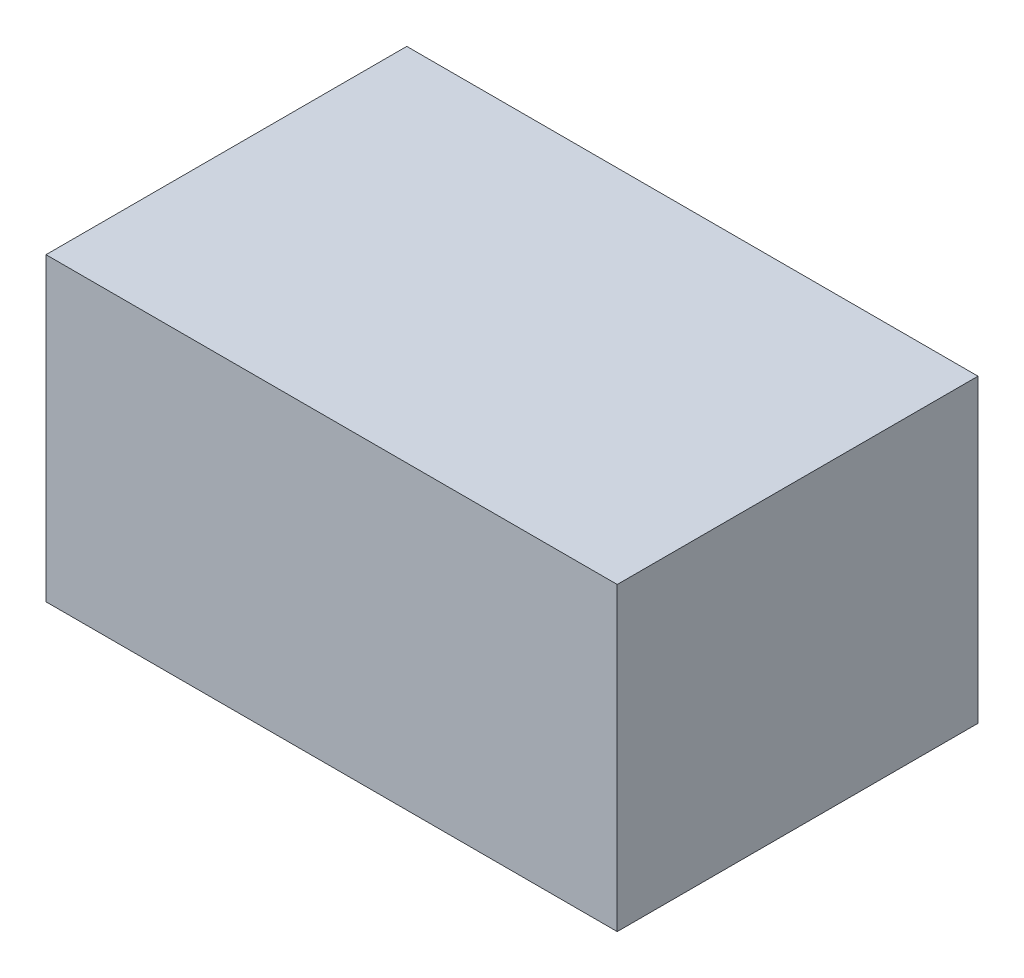
ISO-10303-21;
HEADER;
FILE_DESCRIPTION(('STEP AP214'),'2;1');
FILE_NAME('part.step','',(''),(''),'','','');
FILE_SCHEMA(('AUTOMOTIVE_DESIGN { 1 0 10303 214 1 1 1 1 }'));
ENDSEC;
DATA;
#1=APPLICATION_CONTEXT('core data for automotive mechanical design processes');
#2=APPLICATION_PROTOCOL_DEFINITION('international standard','automotive_design',2000,#1);
#3=PRODUCT_CONTEXT('',#1,'mechanical');
#4=PRODUCT('Part','Part','',(#3));
#5=PRODUCT_RELATED_PRODUCT_CATEGORY('part','',(#4));
#6=PRODUCT_DEFINITION_FORMATION('','',#4);
#7=PRODUCT_DEFINITION_CONTEXT('part definition',#1,'design');
#8=PRODUCT_DEFINITION('design','',#6,#7);
#9=PRODUCT_DEFINITION_SHAPE('','',#8);
#10=(LENGTH_UNIT() NAMED_UNIT(*) SI_UNIT(.MILLI.,.METRE.));
#11=(NAMED_UNIT(*) PLANE_ANGLE_UNIT() SI_UNIT($,.RADIAN.));
#12=(NAMED_UNIT(*) SI_UNIT($,.STERADIAN.) SOLID_ANGLE_UNIT());
#13=UNCERTAINTY_MEASURE_WITH_UNIT(LENGTH_MEASURE(1.E-05),#10,'distance_accuracy_value','');
#14=(GEOMETRIC_REPRESENTATION_CONTEXT(3) GLOBAL_UNCERTAINTY_ASSIGNED_CONTEXT((#13)) GLOBAL_UNIT_ASSIGNED_CONTEXT((#10,
#11,#12)) REPRESENTATION_CONTEXT('',''));
#15=CARTESIAN_POINT('',(0.,0.,0.));
#16=DIRECTION('',(0.,0.,1.));
#17=DIRECTION('',(1.,0.,0.));
#18=AXIS2_PLACEMENT_3D('',#15,#16,#17);
#19=CARTESIAN_POINT('',(0.,250.,0.));
#20=DIRECTION('',(1.,0.,0.));
#21=DIRECTION('',(0.,0.,-1.));
#22=AXIS2_PLACEMENT_3D('',#19,#20,#21);
#23=PLANE('',#22);
#24=DIRECTION('',(0.,0.,1.));
#25=VECTOR('',#24,1.);
#26=CARTESIAN_POINT('',(0.,0.,0.));
#27=LINE('',#26,#25);
#28=CARTESIAN_POINT('',(0.,0.,-300.));
#29=VERTEX_POINT('',#28);
#30=CARTESIAN_POINT('',(0.,0.,0.));
#31=VERTEX_POINT('',#30);
#32=EDGE_CURVE('E122',#29,#31,#27,.T.);
#33=ORIENTED_EDGE('',*,*,#32,.T.);
#34=DIRECTION('',(0.,-1.,0.));
#35=VECTOR('',#34,1.);
#36=CARTESIAN_POINT('',(0.,250.,0.));
#37=LINE('',#36,#35);
#38=CARTESIAN_POINT('',(0.,250.,0.));
#39=VERTEX_POINT('',#38);
#40=EDGE_CURVE('E11',#39,#31,#37,.T.);
#41=ORIENTED_EDGE('',*,*,#40,.F.);
#42=DIRECTION('',(0.,0.,1.));
#43=VECTOR('',#42,1.);
#44=CARTESIAN_POINT('',(0.,250.,0.));
#45=LINE('',#44,#43);
#46=CARTESIAN_POINT('',(0.,250.,-300.));
#47=VERTEX_POINT('',#46);
#48=EDGE_CURVE('E105',#47,#39,#45,.T.);
#49=ORIENTED_EDGE('',*,*,#48,.F.);
#50=DIRECTION('',(0.,-1.,0.));
#51=VECTOR('',#50,1.);
#52=CARTESIAN_POINT('',(0.,250.,-300.));
#53=LINE('',#52,#51);
#54=EDGE_CURVE('E118',#47,#29,#53,.T.);
#55=ORIENTED_EDGE('',*,*,#54,.T.);
#56=EDGE_LOOP('',(#33,#41,#49,#55));
#57=FACE_BOUND('',#56,.T.);
#58=ADVANCED_FACE('F45',(#57),#23,.F.);
#59=CARTESIAN_POINT('',(0.,250.,0.));
#60=DIRECTION('',(0.,0.,-1.));
#61=DIRECTION('',(-1.,0.,0.));
#62=AXIS2_PLACEMENT_3D('',#59,#60,#61);
#63=PLANE('',#62);
#64=DIRECTION('',(1.,0.,0.));
#65=VECTOR('',#64,1.);
#66=CARTESIAN_POINT('',(0.,0.,0.));
#67=LINE('',#66,#65);
#68=CARTESIAN_POINT('',(475.,0.,0.));
#69=VERTEX_POINT('',#68);
#70=EDGE_CURVE('E110',#31,#69,#67,.T.);
#71=ORIENTED_EDGE('',*,*,#70,.T.);
#72=DIRECTION('',(0.,-1.,0.));
#73=VECTOR('',#72,1.);
#74=CARTESIAN_POINT('',(475.,250.,0.));
#75=LINE('',#74,#73);
#76=CARTESIAN_POINT('',(475.,250.,0.));
#77=VERTEX_POINT('',#76);
#78=EDGE_CURVE('E54',#77,#69,#75,.T.);
#79=ORIENTED_EDGE('',*,*,#78,.F.);
#80=DIRECTION('',(1.,0.,0.));
#81=VECTOR('',#80,1.);
#82=CARTESIAN_POINT('',(0.,250.,0.));
#83=LINE('',#82,#81);
#84=EDGE_CURVE('E99',#39,#77,#83,.T.);
#85=ORIENTED_EDGE('',*,*,#84,.F.);
#86=ORIENTED_EDGE('',*,*,#40,.T.);
#87=EDGE_LOOP('',(#71,#79,#85,#86));
#88=FACE_BOUND('',#87,.T.);
#89=ADVANCED_FACE('F109',(#88),#63,.F.);
#90=CARTESIAN_POINT('',(475.,250.,0.));
#91=DIRECTION('',(-1.,0.,0.));
#92=DIRECTION('',(0.,0.,1.));
#93=AXIS2_PLACEMENT_3D('',#90,#91,#92);
#94=PLANE('',#93);
#95=DIRECTION('',(0.,0.,-1.));
#96=VECTOR('',#95,1.);
#97=CARTESIAN_POINT('',(475.,0.,0.));
#98=LINE('',#97,#96);
#99=CARTESIAN_POINT('',(475.,0.,-300.));
#100=VERTEX_POINT('',#99);
#101=EDGE_CURVE('E85',#69,#100,#98,.T.);
#102=ORIENTED_EDGE('',*,*,#101,.T.);
#103=DIRECTION('',(0.,-1.,0.));
#104=VECTOR('',#103,1.);
#105=CARTESIAN_POINT('',(475.,250.,-300.));
#106=LINE('',#105,#104);
#107=CARTESIAN_POINT('',(475.,250.,-300.));
#108=VERTEX_POINT('',#107);
#109=EDGE_CURVE('E112',#108,#100,#106,.T.);
#110=ORIENTED_EDGE('',*,*,#109,.F.);
#111=DIRECTION('',(0.,0.,-1.));
#112=VECTOR('',#111,1.);
#113=CARTESIAN_POINT('',(475.,250.,0.));
#114=LINE('',#113,#112);
#115=EDGE_CURVE('E103',#77,#108,#114,.T.);
#116=ORIENTED_EDGE('',*,*,#115,.F.);
#117=ORIENTED_EDGE('',*,*,#78,.T.);
#118=EDGE_LOOP('',(#102,#110,#116,#117));
#119=FACE_BOUND('',#118,.T.);
#120=ADVANCED_FACE('F113',(#119),#94,.F.);
#121=CARTESIAN_POINT('',(0.,250.,-300.));
#122=DIRECTION('',(0.,0.,1.));
#123=DIRECTION('',(1.,0.,0.));
#124=AXIS2_PLACEMENT_3D('',#121,#122,#123);
#125=PLANE('',#124);
#126=DIRECTION('',(-1.,0.,0.));
#127=VECTOR('',#126,1.);
#128=CARTESIAN_POINT('',(0.,0.,-300.));
#129=LINE('',#128,#127);
#130=EDGE_CURVE('E92',#100,#29,#129,.T.);
#131=ORIENTED_EDGE('',*,*,#130,.T.);
#132=ORIENTED_EDGE('',*,*,#54,.F.);
#133=DIRECTION('',(-1.,0.,0.));
#134=VECTOR('',#133,1.);
#135=CARTESIAN_POINT('',(0.,250.,-300.));
#136=LINE('',#135,#134);
#137=EDGE_CURVE('E65',#108,#47,#136,.T.);
#138=ORIENTED_EDGE('',*,*,#137,.F.);
#139=ORIENTED_EDGE('',*,*,#109,.T.);
#140=EDGE_LOOP('',(#131,#132,#138,#139));
#141=FACE_BOUND('',#140,.T.);
#142=ADVANCED_FACE('F134',(#141),#125,.F.);
#143=CARTESIAN_POINT('',(0.,250.,0.));
#144=DIRECTION('',(0.,-1.,0.));
#145=DIRECTION('',(0.,0.,-1.));
#146=AXIS2_PLACEMENT_3D('',#143,#144,#145);
#147=PLANE('',#146);
#148=ORIENTED_EDGE('',*,*,#48,.T.);
#149=ORIENTED_EDGE('',*,*,#84,.T.);
#150=ORIENTED_EDGE('',*,*,#115,.T.);
#151=ORIENTED_EDGE('',*,*,#137,.T.);
#152=EDGE_LOOP('',(#148,#149,#150,#151));
#153=FACE_BOUND('',#152,.T.);
#154=ADVANCED_FACE('F101',(#153),#147,.F.);
#155=CARTESIAN_POINT('',(0.,0.,0.));
#156=DIRECTION('',(0.,-1.,0.));
#157=DIRECTION('',(0.,0.,-1.));
#158=AXIS2_PLACEMENT_3D('',#155,#156,#157);
#159=PLANE('',#158);
#160=ORIENTED_EDGE('',*,*,#32,.F.);
#161=ORIENTED_EDGE('',*,*,#130,.F.);
#162=ORIENTED_EDGE('',*,*,#101,.F.);
#163=ORIENTED_EDGE('',*,*,#70,.F.);
#164=EDGE_LOOP('',(#160,#161,#162,#163));
#165=FACE_BOUND('',#164,.T.);
#166=ADVANCED_FACE('F137',(#165),#159,.T.);
#167=CLOSED_SHELL('',(#58,#89,#120,#142,#154,#166));
#168=MANIFOLD_SOLID_BREP('B2',#167);
#169=ADVANCED_BREP_SHAPE_REPRESENTATION('',(#18,#168),#14);
#170=SHAPE_DEFINITION_REPRESENTATION(#9,#169);
ENDSEC;
END-ISO-10303-21;
